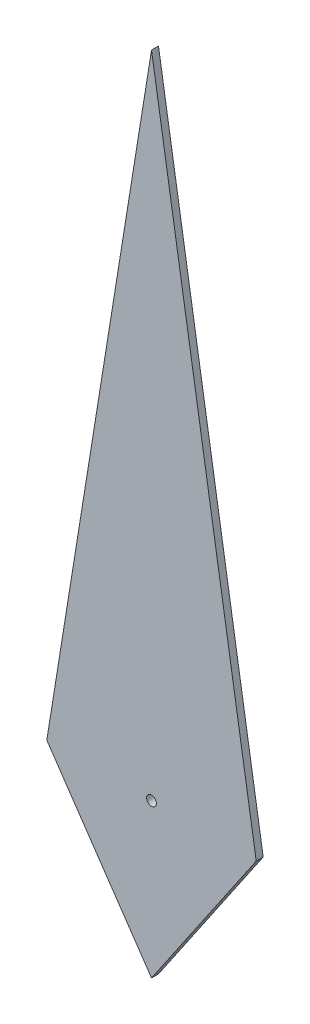
ISO-10303-21;
HEADER;
FILE_DESCRIPTION(('STEP AP214'),'2;1');
FILE_NAME('part.step','',(''),(''),'','','');
FILE_SCHEMA(('AUTOMOTIVE_DESIGN { 1 0 10303 214 1 1 1 1 }'));
ENDSEC;
DATA;
#1=APPLICATION_CONTEXT('core data for automotive mechanical design processes');
#2=APPLICATION_PROTOCOL_DEFINITION('international standard','automotive_design',2000,#1);
#3=PRODUCT_CONTEXT('',#1,'mechanical');
#4=PRODUCT('Part','Part','',(#3));
#5=PRODUCT_RELATED_PRODUCT_CATEGORY('part','',(#4));
#6=PRODUCT_DEFINITION_FORMATION('','',#4);
#7=PRODUCT_DEFINITION_CONTEXT('part definition',#1,'design');
#8=PRODUCT_DEFINITION('design','',#6,#7);
#9=PRODUCT_DEFINITION_SHAPE('','',#8);
#10=(LENGTH_UNIT() NAMED_UNIT(*) SI_UNIT(.MILLI.,.METRE.));
#11=(NAMED_UNIT(*) PLANE_ANGLE_UNIT() SI_UNIT($,.RADIAN.));
#12=(NAMED_UNIT(*) SI_UNIT($,.STERADIAN.) SOLID_ANGLE_UNIT());
#13=UNCERTAINTY_MEASURE_WITH_UNIT(LENGTH_MEASURE(1.E-05),#10,'distance_accuracy_value','');
#14=(GEOMETRIC_REPRESENTATION_CONTEXT(3) GLOBAL_UNCERTAINTY_ASSIGNED_CONTEXT((#13)) GLOBAL_UNIT_ASSIGNED_CONTEXT((#10,
#11,#12)) REPRESENTATION_CONTEXT('',''));
#15=CARTESIAN_POINT('',(0.,0.,0.));
#16=DIRECTION('',(0.,0.,1.));
#17=DIRECTION('',(1.,0.,0.));
#18=AXIS2_PLACEMENT_3D('',#15,#16,#17);
#19=CARTESIAN_POINT('',(-1.5,-0.943040942394614,0.1));
#20=DIRECTION('',(0.,0.,1.));
#21=DIRECTION('',(1.,0.,0.));
#22=AXIS2_PLACEMENT_3D('',#19,#20,#21);
#23=PLANE('',#22);
#24=DIRECTION('',(-0.159032405026307,-0.987273363436667,0.));
#25=VECTOR('',#24,1.);
#26=CARTESIAN_POINT('',(0.,8.36896087830371,0.1));
#27=LINE('',#26,#25);
#28=CARTESIAN_POINT('',(0.,8.36896087830371,0.1));
#29=VERTEX_POINT('',#28);
#30=CARTESIAN_POINT('',(-1.5,-0.943040942394617,0.1));
#31=VERTEX_POINT('',#30);
#32=EDGE_CURVE('E85',#29,#31,#27,.T.);
#33=ORIENTED_EDGE('',*,*,#32,.T.);
#34=DIRECTION('',(0.563261866048486,-0.82627844595849,0.));
#35=VECTOR('',#34,1.);
#36=CARTESIAN_POINT('',(-1.5,-0.943040942394617,0.1));
#37=LINE('',#36,#35);
#38=CARTESIAN_POINT('',(0.,-3.14346980798206,0.1));
#39=VERTEX_POINT('',#38);
#40=EDGE_CURVE('E80',#31,#39,#37,.T.);
#41=ORIENTED_EDGE('',*,*,#40,.T.);
#42=DIRECTION('',(0.563261866048486,0.82627844595849,0.));
#43=VECTOR('',#42,1.);
#44=CARTESIAN_POINT('',(1.5,-0.943040942394617,0.1));
#45=LINE('',#44,#43);
#46=CARTESIAN_POINT('',(1.5,-0.943040942394617,0.1));
#47=VERTEX_POINT('',#46);
#48=EDGE_CURVE('E83',#39,#47,#45,.T.);
#49=ORIENTED_EDGE('',*,*,#48,.T.);
#50=DIRECTION('',(-0.159032405026307,0.987273363436667,0.));
#51=VECTOR('',#50,1.);
#52=CARTESIAN_POINT('',(0.,8.36896087830371,0.1));
#53=LINE('',#52,#51);
#54=EDGE_CURVE('E50',#47,#29,#53,.T.);
#55=ORIENTED_EDGE('',*,*,#54,.T.);
#56=EDGE_LOOP('',(#33,#41,#49,#55));
#57=FACE_BOUND('',#56,.T.);
#58=CARTESIAN_POINT('',(0.,-0.943040942394617,0.1));
#59=DIRECTION('',(0.,0.,1.));
#60=DIRECTION('',(1.,0.,0.));
#61=AXIS2_PLACEMENT_3D('',#58,#59,#60);
#62=CIRCLE('',#61,0.0699999999999997);
#63=CARTESIAN_POINT('',(0.0699999999999997,-0.943040942394617,0.1));
#64=VERTEX_POINT('',#63);
#65=EDGE_CURVE('E100',#64,#64,#62,.T.);
#66=ORIENTED_EDGE('',*,*,#65,.F.);
#67=EDGE_LOOP('',(#66));
#68=FACE_BOUND('',#67,.T.);
#69=ADVANCED_FACE('F33',(#57,#68),#23,.T.);
#70=CARTESIAN_POINT('',(-1.5,-0.943040942394614,0.));
#71=DIRECTION('',(0.,0.,1.));
#72=DIRECTION('',(1.,0.,0.));
#73=AXIS2_PLACEMENT_3D('',#70,#71,#72);
#74=PLANE('',#73);
#75=DIRECTION('',(-0.159032405026307,-0.987273363436667,0.));
#76=VECTOR('',#75,1.);
#77=CARTESIAN_POINT('',(0.,8.36896087830371,0.));
#78=LINE('',#77,#76);
#79=CARTESIAN_POINT('',(0.,8.36896087830371,0.));
#80=VERTEX_POINT('',#79);
#81=CARTESIAN_POINT('',(-1.5,-0.943040942394617,0.));
#82=VERTEX_POINT('',#81);
#83=EDGE_CURVE('E97',#80,#82,#78,.T.);
#84=ORIENTED_EDGE('',*,*,#83,.F.);
#85=DIRECTION('',(-0.159032405026307,0.987273363436667,0.));
#86=VECTOR('',#85,1.);
#87=CARTESIAN_POINT('',(0.,8.36896087830371,0.));
#88=LINE('',#87,#86);
#89=CARTESIAN_POINT('',(1.5,-0.943040942394617,0.));
#90=VERTEX_POINT('',#89);
#91=EDGE_CURVE('E73',#90,#80,#88,.T.);
#92=ORIENTED_EDGE('',*,*,#91,.F.);
#93=DIRECTION('',(0.563261866048486,0.82627844595849,0.));
#94=VECTOR('',#93,1.);
#95=CARTESIAN_POINT('',(1.5,-0.943040942394617,0.));
#96=LINE('',#95,#94);
#97=CARTESIAN_POINT('',(0.,-3.14346980798206,0.));
#98=VERTEX_POINT('',#97);
#99=EDGE_CURVE('E67',#98,#90,#96,.T.);
#100=ORIENTED_EDGE('',*,*,#99,.F.);
#101=DIRECTION('',(0.563261866048486,-0.82627844595849,0.));
#102=VECTOR('',#101,1.);
#103=CARTESIAN_POINT('',(-1.5,-0.943040942394617,0.));
#104=LINE('',#103,#102);
#105=EDGE_CURVE('E89',#82,#98,#104,.T.);
#106=ORIENTED_EDGE('',*,*,#105,.F.);
#107=EDGE_LOOP('',(#84,#92,#100,#106));
#108=FACE_BOUND('',#107,.T.);
#109=CARTESIAN_POINT('',(0.,-0.943040942394617,0.));
#110=DIRECTION('',(0.,0.,1.));
#111=DIRECTION('',(1.,0.,0.));
#112=AXIS2_PLACEMENT_3D('',#109,#110,#111);
#113=CIRCLE('',#112,0.0699999999999997);
#114=CARTESIAN_POINT('',(0.0699999999999997,-0.943040942394617,0.));
#115=VERTEX_POINT('',#114);
#116=EDGE_CURVE('E112',#115,#115,#113,.T.);
#117=ORIENTED_EDGE('',*,*,#116,.T.);
#118=EDGE_LOOP('',(#117));
#119=FACE_BOUND('',#118,.T.);
#120=ADVANCED_FACE('F108',(#108,#119),#74,.F.);
#121=CARTESIAN_POINT('',(0.,8.36896087830371,0.1));
#122=DIRECTION('',(0.987273363436667,-0.159032405026307,0.));
#123=DIRECTION('',(0.159032405026307,0.987273363436667,0.));
#124=AXIS2_PLACEMENT_3D('',#121,#122,#123);
#125=PLANE('',#124);
#126=ORIENTED_EDGE('',*,*,#83,.T.);
#127=DIRECTION('',(0.,0.,-1.));
#128=VECTOR('',#127,1.);
#129=CARTESIAN_POINT('',(-1.5,-0.943040942394617,0.1));
#130=LINE('',#129,#128);
#131=EDGE_CURVE('E11',#31,#82,#130,.T.);
#132=ORIENTED_EDGE('',*,*,#131,.F.);
#133=ORIENTED_EDGE('',*,*,#32,.F.);
#134=DIRECTION('',(0.,0.,-1.));
#135=VECTOR('',#134,1.);
#136=CARTESIAN_POINT('',(0.,8.36896087830371,0.1));
#137=LINE('',#136,#135);
#138=EDGE_CURVE('E93',#29,#80,#137,.T.);
#139=ORIENTED_EDGE('',*,*,#138,.T.);
#140=EDGE_LOOP('',(#126,#132,#133,#139));
#141=FACE_BOUND('',#140,.T.);
#142=ADVANCED_FACE('F35',(#141),#125,.F.);
#143=CARTESIAN_POINT('',(-1.5,-0.943040942394617,0.1));
#144=DIRECTION('',(0.82627844595849,0.563261866048486,0.));
#145=DIRECTION('',(-0.563261866048486,0.82627844595849,0.));
#146=AXIS2_PLACEMENT_3D('',#143,#144,#145);
#147=PLANE('',#146);
#148=ORIENTED_EDGE('',*,*,#105,.T.);
#149=DIRECTION('',(0.,0.,-1.));
#150=VECTOR('',#149,1.);
#151=CARTESIAN_POINT('',(0.,-3.14346980798206,0.1));
#152=LINE('',#151,#150);
#153=EDGE_CURVE('E42',#39,#98,#152,.T.);
#154=ORIENTED_EDGE('',*,*,#153,.F.);
#155=ORIENTED_EDGE('',*,*,#40,.F.);
#156=ORIENTED_EDGE('',*,*,#131,.T.);
#157=EDGE_LOOP('',(#148,#154,#155,#156));
#158=FACE_BOUND('',#157,.T.);
#159=ADVANCED_FACE('F88',(#158),#147,.F.);
#160=CARTESIAN_POINT('',(1.5,-0.943040942394617,0.1));
#161=DIRECTION('',(-0.82627844595849,0.563261866048486,0.));
#162=DIRECTION('',(-0.563261866048486,-0.82627844595849,0.));
#163=AXIS2_PLACEMENT_3D('',#160,#161,#162);
#164=PLANE('',#163);
#165=ORIENTED_EDGE('',*,*,#99,.T.);
#166=DIRECTION('',(0.,0.,-1.));
#167=VECTOR('',#166,1.);
#168=CARTESIAN_POINT('',(1.5,-0.943040942394617,0.1));
#169=LINE('',#168,#167);
#170=EDGE_CURVE('E90',#47,#90,#169,.T.);
#171=ORIENTED_EDGE('',*,*,#170,.F.);
#172=ORIENTED_EDGE('',*,*,#48,.F.);
#173=ORIENTED_EDGE('',*,*,#153,.T.);
#174=EDGE_LOOP('',(#165,#171,#172,#173));
#175=FACE_BOUND('',#174,.T.);
#176=ADVANCED_FACE('F91',(#175),#164,.F.);
#177=CARTESIAN_POINT('',(0.,8.36896087830371,0.1));
#178=DIRECTION('',(-0.987273363436667,-0.159032405026307,0.));
#179=DIRECTION('',(0.159032405026307,-0.987273363436667,0.));
#180=AXIS2_PLACEMENT_3D('',#177,#178,#179);
#181=PLANE('',#180);
#182=ORIENTED_EDGE('',*,*,#91,.T.);
#183=ORIENTED_EDGE('',*,*,#138,.F.);
#184=ORIENTED_EDGE('',*,*,#54,.F.);
#185=ORIENTED_EDGE('',*,*,#170,.T.);
#186=EDGE_LOOP('',(#182,#183,#184,#185));
#187=FACE_BOUND('',#186,.T.);
#188=ADVANCED_FACE('F105',(#187),#181,.F.);
#189=CARTESIAN_POINT('',(0.,-0.943040942394617,0.1));
#190=DIRECTION('',(0.,0.,-1.));
#191=DIRECTION('',(-1.,0.,0.));
#192=AXIS2_PLACEMENT_3D('',#189,#190,#191);
#193=CYLINDRICAL_SURFACE('',#192,0.0699999999999997);
#194=ORIENTED_EDGE('',*,*,#65,.T.);
#195=EDGE_LOOP('',(#194));
#196=FACE_BOUND('',#195,.T.);
#197=ORIENTED_EDGE('',*,*,#116,.F.);
#198=EDGE_LOOP('',(#197));
#199=FACE_BOUND('',#198,.T.);
#200=ADVANCED_FACE('F118',(#196,#199),#193,.F.);
#201=CLOSED_SHELL('',(#69,#120,#142,#159,#176,#188,#200));
#202=MANIFOLD_SOLID_BREP('B2',#201);
#203=ADVANCED_BREP_SHAPE_REPRESENTATION('',(#18,#202),#14);
#204=SHAPE_DEFINITION_REPRESENTATION(#9,#203);
ENDSEC;
END-ISO-10303-21;
